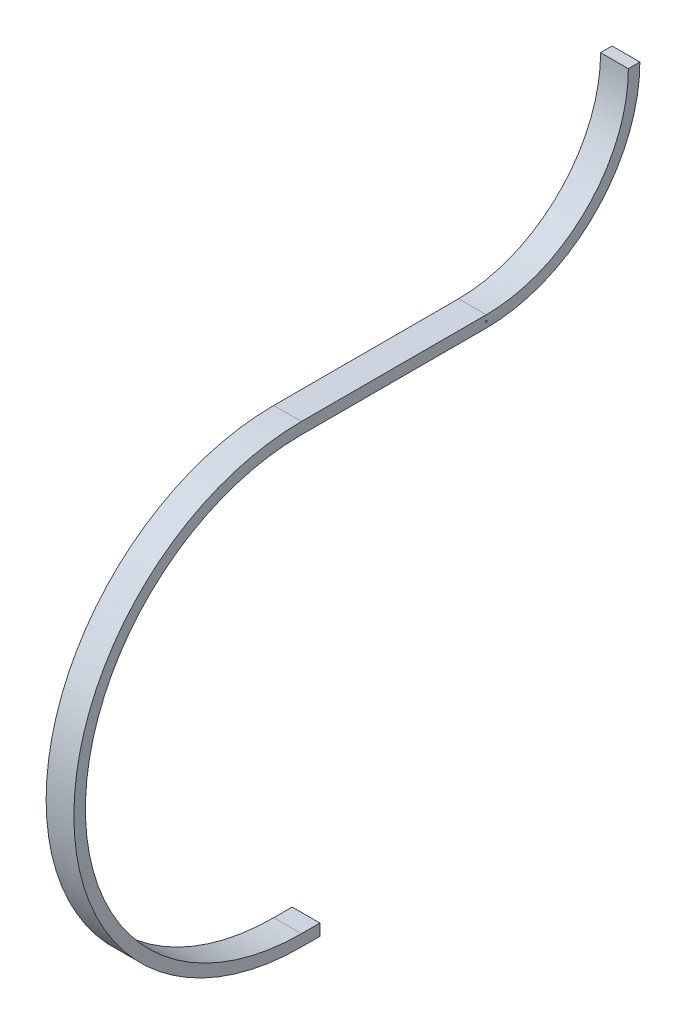
ISO-10303-21;
HEADER;
FILE_DESCRIPTION(('STEP AP214'),'2;1');
FILE_NAME('part.step','',(''),(''),'','','');
FILE_SCHEMA(('AUTOMOTIVE_DESIGN { 1 0 10303 214 1 1 1 1 }'));
ENDSEC;
DATA;
#1=APPLICATION_CONTEXT('core data for automotive mechanical design processes');
#2=APPLICATION_PROTOCOL_DEFINITION('international standard','automotive_design',2000,#1);
#3=PRODUCT_CONTEXT('',#1,'mechanical');
#4=PRODUCT('Part','Part','',(#3));
#5=PRODUCT_RELATED_PRODUCT_CATEGORY('part','',(#4));
#6=PRODUCT_DEFINITION_FORMATION('','',#4);
#7=PRODUCT_DEFINITION_CONTEXT('part definition',#1,'design');
#8=PRODUCT_DEFINITION('design','',#6,#7);
#9=PRODUCT_DEFINITION_SHAPE('','',#8);
#10=(LENGTH_UNIT() NAMED_UNIT(*) SI_UNIT(.MILLI.,.METRE.));
#11=(NAMED_UNIT(*) PLANE_ANGLE_UNIT() SI_UNIT($,.RADIAN.));
#12=(NAMED_UNIT(*) SI_UNIT($,.STERADIAN.) SOLID_ANGLE_UNIT());
#13=UNCERTAINTY_MEASURE_WITH_UNIT(LENGTH_MEASURE(1.E-05),#10,'distance_accuracy_value','');
#14=(GEOMETRIC_REPRESENTATION_CONTEXT(3) GLOBAL_UNCERTAINTY_ASSIGNED_CONTEXT((#13)) GLOBAL_UNIT_ASSIGNED_CONTEXT((#10,
#11,#12)) REPRESENTATION_CONTEXT('',''));
#15=CARTESIAN_POINT('',(0.,0.,0.));
#16=DIRECTION('',(0.,0.,1.));
#17=DIRECTION('',(1.,0.,0.));
#18=AXIS2_PLACEMENT_3D('',#15,#16,#17);
#19=CARTESIAN_POINT('',(0.,406.4,-127.));
#20=DIRECTION('',(1.,0.,0.));
#21=DIRECTION('',(0.,0.,-1.));
#22=AXIS2_PLACEMENT_3D('',#19,#20,#21);
#23=CYLINDRICAL_SURFACE('',#22,105.5624);
#24=DIRECTION('',(-1.,0.,0.));
#25=VECTOR('',#24,1.);
#26=CARTESIAN_POINT('',(-9.525,300.8376,-127.));
#27=LINE('',#26,#25);
#28=CARTESIAN_POINT('',(9.525,300.8376,-127.));
#29=VERTEX_POINT('',#28);
#30=CARTESIAN_POINT('',(-9.525,300.8376,-127.));
#31=VERTEX_POINT('',#30);
#32=EDGE_CURVE('E175',#29,#31,#27,.T.);
#33=ORIENTED_EDGE('',*,*,#32,.T.);
#34=CARTESIAN_POINT('',(-9.525,406.4,-127.));
#35=DIRECTION('',(1.,0.,0.));
#36=DIRECTION('',(0.,0.,-1.));
#37=AXIS2_PLACEMENT_3D('',#34,#35,#36);
#38=CIRCLE('',#37,105.5624);
#39=CARTESIAN_POINT('',(-9.525,406.4,-232.5624));
#40=VERTEX_POINT('',#39);
#41=EDGE_CURVE('E42',#31,#40,#38,.T.);
#42=ORIENTED_EDGE('',*,*,#41,.T.);
#43=DIRECTION('',(-1.,0.,0.));
#44=VECTOR('',#43,1.);
#45=CARTESIAN_POINT('',(-9.525,406.4,-232.5624));
#46=LINE('',#45,#44);
#47=CARTESIAN_POINT('',(9.525,406.4,-232.5624));
#48=VERTEX_POINT('',#47);
#49=EDGE_CURVE('E49',#48,#40,#46,.T.);
#50=ORIENTED_EDGE('',*,*,#49,.F.);
#51=CARTESIAN_POINT('',(9.525,406.4,-127.));
#52=DIRECTION('',(1.,0.,0.));
#53=DIRECTION('',(0.,0.,-1.));
#54=AXIS2_PLACEMENT_3D('',#51,#52,#53);
#55=CIRCLE('',#54,105.5624);
#56=EDGE_CURVE('E11',#29,#48,#55,.T.);
#57=ORIENTED_EDGE('',*,*,#56,.F.);
#58=EDGE_LOOP('',(#33,#42,#50,#57));
#59=FACE_BOUND('',#58,.T.);
#60=ADVANCED_FACE('F35',(#59),#23,.T.);
#61=CARTESIAN_POINT('',(0.,406.4,-127.));
#62=DIRECTION('',(1.,0.,0.));
#63=DIRECTION('',(0.,0.,-1.));
#64=AXIS2_PLACEMENT_3D('',#61,#62,#63);
#65=CYLINDRICAL_SURFACE('',#64,97.6375999999999);
#66=DIRECTION('',(1.,0.,0.));
#67=VECTOR('',#66,1.);
#68=CARTESIAN_POINT('',(-9.525,308.7624,-127.));
#69=LINE('',#68,#67);
#70=CARTESIAN_POINT('',(-9.525,308.7624,-127.));
#71=VERTEX_POINT('',#70);
#72=CARTESIAN_POINT('',(9.525,308.7624,-127.));
#73=VERTEX_POINT('',#72);
#74=EDGE_CURVE('E172',#71,#73,#69,.T.);
#75=ORIENTED_EDGE('',*,*,#74,.T.);
#76=CARTESIAN_POINT('',(9.525,406.4,-127.));
#77=DIRECTION('',(1.,0.,0.));
#78=DIRECTION('',(0.,0.,-1.));
#79=AXIS2_PLACEMENT_3D('',#76,#77,#78);
#80=CIRCLE('',#79,97.6375999999999);
#81=CARTESIAN_POINT('',(9.525,406.4,-224.6376));
#82=VERTEX_POINT('',#81);
#83=EDGE_CURVE('E197',#73,#82,#80,.T.);
#84=ORIENTED_EDGE('',*,*,#83,.T.);
#85=DIRECTION('',(1.,0.,0.));
#86=VECTOR('',#85,1.);
#87=CARTESIAN_POINT('',(-9.525,406.4,-224.6376));
#88=LINE('',#87,#86);
#89=CARTESIAN_POINT('',(-9.525,406.4,-224.6376));
#90=VERTEX_POINT('',#89);
#91=EDGE_CURVE('E192',#90,#82,#88,.T.);
#92=ORIENTED_EDGE('',*,*,#91,.F.);
#93=CARTESIAN_POINT('',(-9.525,406.4,-127.));
#94=DIRECTION('',(1.,0.,0.));
#95=DIRECTION('',(0.,0.,-1.));
#96=AXIS2_PLACEMENT_3D('',#93,#94,#95);
#97=CIRCLE('',#96,97.6375999999999);
#98=EDGE_CURVE('E200',#71,#90,#97,.T.);
#99=ORIENTED_EDGE('',*,*,#98,.F.);
#100=EDGE_LOOP('',(#75,#84,#92,#99));
#101=FACE_BOUND('',#100,.T.);
#102=ADVANCED_FACE('F215',(#101),#65,.F.);
#103=CARTESIAN_POINT('',(-9.525,300.8376,0.));
#104=DIRECTION('',(0.,-1.,0.));
#105=DIRECTION('',(0.,0.,-1.));
#106=AXIS2_PLACEMENT_3D('',#103,#104,#105);
#107=PLANE('',#106);
#108=DIRECTION('',(-1.,0.,0.));
#109=VECTOR('',#108,1.);
#110=CARTESIAN_POINT('',(-9.525,300.8376,0.));
#111=LINE('',#110,#109);
#112=CARTESIAN_POINT('',(9.525,300.8376,0.));
#113=VERTEX_POINT('',#112);
#114=CARTESIAN_POINT('',(-9.525,300.8376,0.));
#115=VERTEX_POINT('',#114);
#116=EDGE_CURVE('E156',#113,#115,#111,.T.);
#117=ORIENTED_EDGE('',*,*,#116,.T.);
#118=DIRECTION('',(0.,0.,-1.));
#119=VECTOR('',#118,1.);
#120=CARTESIAN_POINT('',(-9.525,300.8376,0.));
#121=LINE('',#120,#119);
#122=EDGE_CURVE('E184',#115,#31,#121,.T.);
#123=ORIENTED_EDGE('',*,*,#122,.T.);
#124=ORIENTED_EDGE('',*,*,#32,.F.);
#125=DIRECTION('',(0.,0.,-1.));
#126=VECTOR('',#125,1.);
#127=CARTESIAN_POINT('',(9.525,300.8376,0.));
#128=LINE('',#127,#126);
#129=EDGE_CURVE('E187',#113,#29,#128,.T.);
#130=ORIENTED_EDGE('',*,*,#129,.F.);
#131=EDGE_LOOP('',(#117,#123,#124,#130));
#132=FACE_BOUND('',#131,.T.);
#133=ADVANCED_FACE('F207',(#132),#107,.T.);
#134=CARTESIAN_POINT('',(-9.525,308.7624,0.));
#135=DIRECTION('',(0.,1.,0.));
#136=DIRECTION('',(0.,0.,1.));
#137=AXIS2_PLACEMENT_3D('',#134,#135,#136);
#138=PLANE('',#137);
#139=DIRECTION('',(1.,0.,0.));
#140=VECTOR('',#139,1.);
#141=CARTESIAN_POINT('',(-9.525,308.7624,0.));
#142=LINE('',#141,#140);
#143=CARTESIAN_POINT('',(-9.525,308.7624,0.));
#144=VERTEX_POINT('',#143);
#145=CARTESIAN_POINT('',(9.525,308.7624,0.));
#146=VERTEX_POINT('',#145);
#147=EDGE_CURVE('E159',#144,#146,#142,.T.);
#148=ORIENTED_EDGE('',*,*,#147,.T.);
#149=DIRECTION('',(0.,0.,-1.));
#150=VECTOR('',#149,1.);
#151=CARTESIAN_POINT('',(9.525,308.7624,0.));
#152=LINE('',#151,#150);
#153=EDGE_CURVE('E178',#146,#73,#152,.T.);
#154=ORIENTED_EDGE('',*,*,#153,.T.);
#155=ORIENTED_EDGE('',*,*,#74,.F.);
#156=DIRECTION('',(0.,0.,-1.));
#157=VECTOR('',#156,1.);
#158=CARTESIAN_POINT('',(-9.525,308.7624,0.));
#159=LINE('',#158,#157);
#160=EDGE_CURVE('E181',#144,#71,#159,.T.);
#161=ORIENTED_EDGE('',*,*,#160,.F.);
#162=EDGE_LOOP('',(#148,#154,#155,#161));
#163=FACE_BOUND('',#162,.T.);
#164=ADVANCED_FACE('F218',(#163),#138,.T.);
#165=CARTESIAN_POINT('',(9.525,300.8376,0.));
#166=DIRECTION('',(-1.,0.,0.));
#167=DIRECTION('',(0.,0.,1.));
#168=AXIS2_PLACEMENT_3D('',#165,#166,#167);
#169=PLANE('',#168);
#170=CARTESIAN_POINT('',(9.525,304.8,-127.));
#171=DIRECTION('',(1.,0.,0.));
#172=DIRECTION('',(0.,0.,-1.));
#173=AXIS2_PLACEMENT_3D('',#170,#171,#172);
#174=CIRCLE('',#173,0.590549999999967);
#175=CARTESIAN_POINT('',(9.525,304.8,-127.59055));
#176=VERTEX_POINT('',#175);
#177=EDGE_CURVE('E141',#176,#176,#174,.T.);
#178=ORIENTED_EDGE('',*,*,#177,.F.);
#179=EDGE_LOOP('',(#178));
#180=FACE_BOUND('',#179,.T.);
#181=CARTESIAN_POINT('',(9.525,152.4,0.));
#182=DIRECTION('',(1.,0.,0.));
#183=DIRECTION('',(0.,0.,-1.));
#184=AXIS2_PLACEMENT_3D('',#181,#182,#183);
#185=CIRCLE('',#184,148.4376);
#186=CARTESIAN_POINT('',(9.525,3.9624,0.));
#187=VERTEX_POINT('',#186);
#188=EDGE_CURVE('E169',#113,#187,#185,.T.);
#189=ORIENTED_EDGE('',*,*,#188,.F.);
#190=ORIENTED_EDGE('',*,*,#129,.T.);
#191=ORIENTED_EDGE('',*,*,#56,.T.);
#192=DIRECTION('',(0.,0.,-1.));
#193=VECTOR('',#192,1.);
#194=CARTESIAN_POINT('',(9.525,406.4,-232.5624));
#195=LINE('',#194,#193);
#196=EDGE_CURVE('E190',#82,#48,#195,.T.);
#197=ORIENTED_EDGE('',*,*,#196,.F.);
#198=ORIENTED_EDGE('',*,*,#83,.F.);
#199=ORIENTED_EDGE('',*,*,#153,.F.);
#200=CARTESIAN_POINT('',(9.525,152.4,0.));
#201=DIRECTION('',(1.,0.,0.));
#202=DIRECTION('',(0.,0.,-1.));
#203=AXIS2_PLACEMENT_3D('',#200,#201,#202);
#204=CIRCLE('',#203,156.3624);
#205=CARTESIAN_POINT('',(9.525,-3.9624,0.));
#206=VERTEX_POINT('',#205);
#207=EDGE_CURVE('E136',#146,#206,#204,.T.);
#208=ORIENTED_EDGE('',*,*,#207,.T.);
#209=DIRECTION('',(0.,0.,-1.));
#210=VECTOR('',#209,1.);
#211=CARTESIAN_POINT('',(9.525,-3.9624,-12.7));
#212=LINE('',#211,#210);
#213=CARTESIAN_POINT('',(9.525,-3.9624,-12.7));
#214=VERTEX_POINT('',#213);
#215=EDGE_CURVE('E116',#206,#214,#212,.T.);
#216=ORIENTED_EDGE('',*,*,#215,.T.);
#217=DIRECTION('',(0.,1.,0.));
#218=VECTOR('',#217,1.);
#219=CARTESIAN_POINT('',(9.525,3.9624,-12.7));
#220=LINE('',#219,#218);
#221=CARTESIAN_POINT('',(9.525,3.9624,-12.7));
#222=VERTEX_POINT('',#221);
#223=EDGE_CURVE('E126',#214,#222,#220,.T.);
#224=ORIENTED_EDGE('',*,*,#223,.T.);
#225=DIRECTION('',(0.,0.,1.));
#226=VECTOR('',#225,1.);
#227=CARTESIAN_POINT('',(9.525,3.9624,0.));
#228=LINE('',#227,#226);
#229=EDGE_CURVE('E123',#222,#187,#228,.T.);
#230=ORIENTED_EDGE('',*,*,#229,.T.);
#231=EDGE_LOOP('',(#189,#190,#191,#197,#198,#199,#208,#216,#224,#230));
#232=FACE_BOUND('',#231,.T.);
#233=ADVANCED_FACE('F134',(#180,#232),#169,.F.);
#234=CARTESIAN_POINT('',(0.,152.4,0.));
#235=DIRECTION('',(1.,0.,0.));
#236=DIRECTION('',(0.,0.,-1.));
#237=AXIS2_PLACEMENT_3D('',#234,#235,#236);
#238=CYLINDRICAL_SURFACE('',#237,148.4376);
#239=CARTESIAN_POINT('',(-9.525,152.4,0.));
#240=DIRECTION('',(1.,0.,0.));
#241=DIRECTION('',(0.,0.,-1.));
#242=AXIS2_PLACEMENT_3D('',#239,#240,#241);
#243=CIRCLE('',#242,148.4376);
#244=CARTESIAN_POINT('',(-9.525,3.9624,0.));
#245=VERTEX_POINT('',#244);
#246=EDGE_CURVE('E166',#115,#245,#243,.T.);
#247=ORIENTED_EDGE('',*,*,#246,.F.);
#248=ORIENTED_EDGE('',*,*,#116,.F.);
#249=ORIENTED_EDGE('',*,*,#188,.T.);
#250=DIRECTION('',(-1.,0.,0.));
#251=VECTOR('',#250,1.);
#252=CARTESIAN_POINT('',(-9.525,3.9624,0.));
#253=LINE('',#252,#251);
#254=EDGE_CURVE('E151',#187,#245,#253,.T.);
#255=ORIENTED_EDGE('',*,*,#254,.T.);
#256=EDGE_LOOP('',(#247,#248,#249,#255));
#257=FACE_BOUND('',#256,.T.);
#258=ADVANCED_FACE('F209',(#257),#238,.F.);
#259=CARTESIAN_POINT('',(-9.525,300.8376,0.));
#260=DIRECTION('',(1.,0.,0.));
#261=DIRECTION('',(0.,0.,-1.));
#262=AXIS2_PLACEMENT_3D('',#259,#260,#261);
#263=PLANE('',#262);
#264=CARTESIAN_POINT('',(-9.52500000000001,304.8,-127.));
#265=DIRECTION('',(1.,0.,0.));
#266=DIRECTION('',(0.,0.,-1.));
#267=AXIS2_PLACEMENT_3D('',#264,#265,#266);
#268=CIRCLE('',#267,0.590549999999967);
#269=CARTESIAN_POINT('',(-9.52500000000001,304.8,-127.59055));
#270=VERTEX_POINT('',#269);
#271=EDGE_CURVE('E138',#270,#270,#268,.T.);
#272=ORIENTED_EDGE('',*,*,#271,.T.);
#273=EDGE_LOOP('',(#272));
#274=FACE_BOUND('',#273,.T.);
#275=CARTESIAN_POINT('',(-9.525,152.4,0.));
#276=DIRECTION('',(1.,0.,0.));
#277=DIRECTION('',(0.,0.,-1.));
#278=AXIS2_PLACEMENT_3D('',#275,#276,#277);
#279=CIRCLE('',#278,156.3624);
#280=CARTESIAN_POINT('',(-9.525,-3.9624,0.));
#281=VERTEX_POINT('',#280);
#282=EDGE_CURVE('E163',#144,#281,#279,.T.);
#283=ORIENTED_EDGE('',*,*,#282,.F.);
#284=ORIENTED_EDGE('',*,*,#160,.T.);
#285=ORIENTED_EDGE('',*,*,#98,.T.);
#286=DIRECTION('',(0.,0.,1.));
#287=VECTOR('',#286,1.);
#288=CARTESIAN_POINT('',(-9.525,406.4,-232.5624));
#289=LINE('',#288,#287);
#290=EDGE_CURVE('E57',#40,#90,#289,.T.);
#291=ORIENTED_EDGE('',*,*,#290,.F.);
#292=ORIENTED_EDGE('',*,*,#41,.F.);
#293=ORIENTED_EDGE('',*,*,#122,.F.);
#294=ORIENTED_EDGE('',*,*,#246,.T.);
#295=DIRECTION('',(0.,0.,-1.));
#296=VECTOR('',#295,1.);
#297=CARTESIAN_POINT('',(-9.525,3.9624,0.));
#298=LINE('',#297,#296);
#299=CARTESIAN_POINT('',(-9.525,3.9624,-12.7));
#300=VERTEX_POINT('',#299);
#301=EDGE_CURVE('E147',#245,#300,#298,.T.);
#302=ORIENTED_EDGE('',*,*,#301,.T.);
#303=DIRECTION('',(0.,-1.,0.));
#304=VECTOR('',#303,1.);
#305=CARTESIAN_POINT('',(-9.525,3.9624,-12.7));
#306=LINE('',#305,#304);
#307=CARTESIAN_POINT('',(-9.525,-3.9624,-12.7));
#308=VERTEX_POINT('',#307);
#309=EDGE_CURVE('E149',#300,#308,#306,.T.);
#310=ORIENTED_EDGE('',*,*,#309,.T.);
#311=DIRECTION('',(0.,0.,1.));
#312=VECTOR('',#311,1.);
#313=CARTESIAN_POINT('',(-9.525,-3.9624,-12.7));
#314=LINE('',#313,#312);
#315=EDGE_CURVE('E119',#308,#281,#314,.T.);
#316=ORIENTED_EDGE('',*,*,#315,.T.);
#317=EDGE_LOOP('',(#283,#284,#285,#291,#292,#293,#294,#302,#310,#316));
#318=FACE_BOUND('',#317,.T.);
#319=ADVANCED_FACE('F203',(#274,#318),#263,.F.);
#320=CARTESIAN_POINT('',(0.,152.4,0.));
#321=DIRECTION('',(1.,0.,0.));
#322=DIRECTION('',(0.,0.,-1.));
#323=AXIS2_PLACEMENT_3D('',#320,#321,#322);
#324=CYLINDRICAL_SURFACE('',#323,156.3624);
#325=ORIENTED_EDGE('',*,*,#147,.F.);
#326=ORIENTED_EDGE('',*,*,#282,.T.);
#327=DIRECTION('',(1.,0.,0.));
#328=VECTOR('',#327,1.);
#329=CARTESIAN_POINT('',(-9.525,-3.9624,0.));
#330=LINE('',#329,#328);
#331=EDGE_CURVE('E154',#281,#206,#330,.T.);
#332=ORIENTED_EDGE('',*,*,#331,.T.);
#333=ORIENTED_EDGE('',*,*,#207,.F.);
#334=EDGE_LOOP('',(#325,#326,#332,#333));
#335=FACE_BOUND('',#334,.T.);
#336=ADVANCED_FACE('F221',(#335),#324,.T.);
#337=CARTESIAN_POINT('',(9.52499999999999,406.4,-224.6376));
#338=DIRECTION('',(0.,1.,0.));
#339=DIRECTION('',(1.,0.,0.));
#340=AXIS2_PLACEMENT_3D('',#337,#338,#339);
#341=PLANE('',#340);
#342=ORIENTED_EDGE('',*,*,#196,.T.);
#343=ORIENTED_EDGE('',*,*,#49,.T.);
#344=ORIENTED_EDGE('',*,*,#290,.T.);
#345=ORIENTED_EDGE('',*,*,#91,.T.);
#346=EDGE_LOOP('',(#342,#343,#344,#345));
#347=FACE_BOUND('',#346,.T.);
#348=ADVANCED_FACE('F213',(#347),#341,.T.);
#349=CARTESIAN_POINT('',(-24.4947179345504,-3.9624,-12.7));
#350=DIRECTION('',(0.,-1.,0.));
#351=DIRECTION('',(0.,0.,-1.));
#352=AXIS2_PLACEMENT_3D('',#349,#350,#351);
#353=PLANE('',#352);
#354=ORIENTED_EDGE('',*,*,#315,.F.);
#355=DIRECTION('',(1.,0.,0.));
#356=VECTOR('',#355,1.);
#357=CARTESIAN_POINT('',(-24.4947179345504,-3.9624,-12.7));
#358=LINE('',#357,#356);
#359=EDGE_CURVE('E112',#308,#214,#358,.T.);
#360=ORIENTED_EDGE('',*,*,#359,.T.);
#361=ORIENTED_EDGE('',*,*,#215,.F.);
#362=ORIENTED_EDGE('',*,*,#331,.F.);
#363=EDGE_LOOP('',(#354,#360,#361,#362));
#364=FACE_BOUND('',#363,.T.);
#365=ADVANCED_FACE('F114',(#364),#353,.T.);
#366=CARTESIAN_POINT('',(-24.4947179345504,3.9624,0.));
#367=DIRECTION('',(0.,1.,0.));
#368=DIRECTION('',(0.,0.,1.));
#369=AXIS2_PLACEMENT_3D('',#366,#367,#368);
#370=PLANE('',#369);
#371=ORIENTED_EDGE('',*,*,#301,.F.);
#372=ORIENTED_EDGE('',*,*,#254,.F.);
#373=ORIENTED_EDGE('',*,*,#229,.F.);
#374=DIRECTION('',(1.,0.,0.));
#375=VECTOR('',#374,1.);
#376=CARTESIAN_POINT('',(-24.4947179345504,3.9624,-12.7));
#377=LINE('',#376,#375);
#378=EDGE_CURVE('E122',#300,#222,#377,.T.);
#379=ORIENTED_EDGE('',*,*,#378,.F.);
#380=EDGE_LOOP('',(#371,#372,#373,#379));
#381=FACE_BOUND('',#380,.T.);
#382=ADVANCED_FACE('F211',(#381),#370,.T.);
#383=CARTESIAN_POINT('',(-24.4947179345504,3.9624,-12.7));
#384=DIRECTION('',(0.,0.,-1.));
#385=DIRECTION('',(0.,1.,0.));
#386=AXIS2_PLACEMENT_3D('',#383,#384,#385);
#387=PLANE('',#386);
#388=ORIENTED_EDGE('',*,*,#309,.F.);
#389=ORIENTED_EDGE('',*,*,#378,.T.);
#390=ORIENTED_EDGE('',*,*,#223,.F.);
#391=ORIENTED_EDGE('',*,*,#359,.F.);
#392=EDGE_LOOP('',(#388,#389,#390,#391));
#393=FACE_BOUND('',#392,.T.);
#394=ADVANCED_FACE('F127',(#393),#387,.T.);
#395=CARTESIAN_POINT('',(9.525,304.8,-127.));
#396=DIRECTION('',(1.,0.,0.));
#397=DIRECTION('',(0.,0.,-1.));
#398=AXIS2_PLACEMENT_3D('',#395,#396,#397);
#399=CYLINDRICAL_SURFACE('',#398,0.590549999999967);
#400=ORIENTED_EDGE('',*,*,#271,.F.);
#401=EDGE_LOOP('',(#400));
#402=FACE_BOUND('',#401,.T.);
#403=ORIENTED_EDGE('',*,*,#177,.T.);
#404=EDGE_LOOP('',(#403));
#405=FACE_BOUND('',#404,.T.);
#406=ADVANCED_FACE('F226',(#402,#405),#399,.F.);
#407=CLOSED_SHELL('',(#60,#102,#133,#164,#233,#258,#319,#336,#348,#365,#382,#394,#406));
#408=MANIFOLD_SOLID_BREP('B2',#407);
#409=ADVANCED_BREP_SHAPE_REPRESENTATION('',(#18,#408),#14);
#410=SHAPE_DEFINITION_REPRESENTATION(#9,#409);
ENDSEC;
END-ISO-10303-21;
